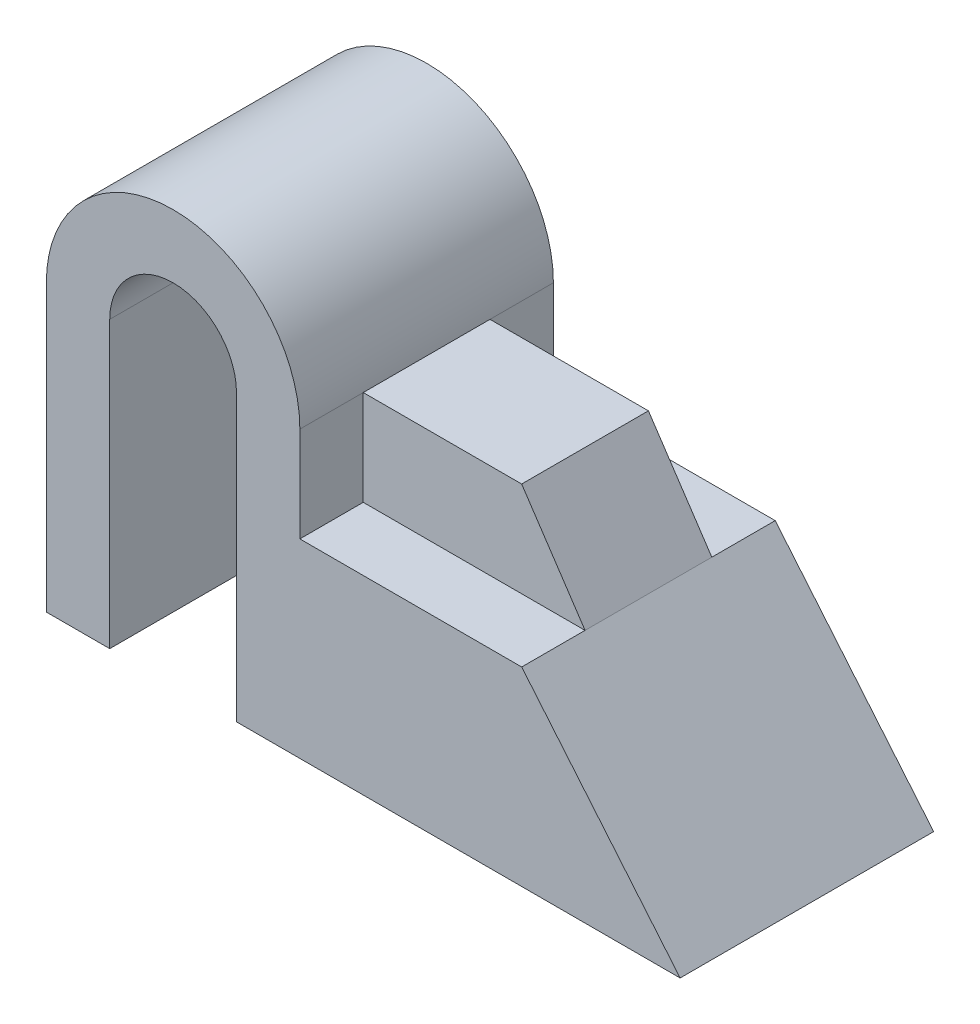
ISO-10303-21;
HEADER;
FILE_DESCRIPTION(('STEP AP214'),'2;1');
FILE_NAME('part.step','',(''),(''),'','','');
FILE_SCHEMA(('AUTOMOTIVE_DESIGN { 1 0 10303 214 1 1 1 1 }'));
ENDSEC;
DATA;
#1=APPLICATION_CONTEXT('core data for automotive mechanical design processes');
#2=APPLICATION_PROTOCOL_DEFINITION('international standard','automotive_design',2000,#1);
#3=PRODUCT_CONTEXT('',#1,'mechanical');
#4=PRODUCT('Part','Part','',(#3));
#5=PRODUCT_RELATED_PRODUCT_CATEGORY('part','',(#4));
#6=PRODUCT_DEFINITION_FORMATION('','',#4);
#7=PRODUCT_DEFINITION_CONTEXT('part definition',#1,'design');
#8=PRODUCT_DEFINITION('design','',#6,#7);
#9=PRODUCT_DEFINITION_SHAPE('','',#8);
#10=(LENGTH_UNIT() NAMED_UNIT(*) SI_UNIT(.MILLI.,.METRE.));
#11=(NAMED_UNIT(*) PLANE_ANGLE_UNIT() SI_UNIT($,.RADIAN.));
#12=(NAMED_UNIT(*) SI_UNIT($,.STERADIAN.) SOLID_ANGLE_UNIT());
#13=UNCERTAINTY_MEASURE_WITH_UNIT(LENGTH_MEASURE(1.E-05),#10,'distance_accuracy_value','');
#14=(GEOMETRIC_REPRESENTATION_CONTEXT(3) GLOBAL_UNCERTAINTY_ASSIGNED_CONTEXT((#13)) GLOBAL_UNIT_ASSIGNED_CONTEXT((#10,
#11,#12)) REPRESENTATION_CONTEXT('',''));
#15=CARTESIAN_POINT('',(0.,0.,0.));
#16=DIRECTION('',(0.,0.,1.));
#17=DIRECTION('',(1.,0.,0.));
#18=AXIS2_PLACEMENT_3D('',#15,#16,#17);
#19=CARTESIAN_POINT('',(0.,0.,20.));
#20=DIRECTION('',(0.,1.,0.));
#21=DIRECTION('',(0.,0.,1.));
#22=AXIS2_PLACEMENT_3D('',#19,#20,#21);
#23=PLANE('',#22);
#24=DIRECTION('',(0.,0.,1.));
#25=VECTOR('',#24,1.);
#26=CARTESIAN_POINT('',(10.,0.,-20.));
#27=LINE('',#26,#25);
#28=CARTESIAN_POINT('',(10.,0.,-20.));
#29=VERTEX_POINT('',#28);
#30=CARTESIAN_POINT('',(10.,0.,20.));
#31=VERTEX_POINT('',#30);
#32=EDGE_CURVE('E140',#29,#31,#27,.T.);
#33=ORIENTED_EDGE('',*,*,#32,.T.);
#34=DIRECTION('',(1.,0.,0.));
#35=VECTOR('',#34,1.);
#36=CARTESIAN_POINT('',(0.,0.,20.));
#37=LINE('',#36,#35);
#38=CARTESIAN_POINT('',(0.,0.,20.));
#39=VERTEX_POINT('',#38);
#40=EDGE_CURVE('E200',#39,#31,#37,.T.);
#41=ORIENTED_EDGE('',*,*,#40,.F.);
#42=DIRECTION('',(0.,0.,-1.));
#43=VECTOR('',#42,1.);
#44=CARTESIAN_POINT('',(0.,0.,20.));
#45=LINE('',#44,#43);
#46=CARTESIAN_POINT('',(0.,0.,-20.));
#47=VERTEX_POINT('',#46);
#48=EDGE_CURVE('E11',#39,#47,#45,.T.);
#49=ORIENTED_EDGE('',*,*,#48,.T.);
#50=DIRECTION('',(1.,0.,0.));
#51=VECTOR('',#50,1.);
#52=CARTESIAN_POINT('',(0.,0.,-20.));
#53=LINE('',#52,#51);
#54=EDGE_CURVE('E215',#47,#29,#53,.T.);
#55=ORIENTED_EDGE('',*,*,#54,.T.);
#56=EDGE_LOOP('',(#33,#41,#49,#55));
#57=FACE_BOUND('',#56,.T.);
#58=ADVANCED_FACE('F33',(#57),#23,.F.);
#59=CARTESIAN_POINT('',(20.,45.,20.));
#60=DIRECTION('',(0.,0.,-1.));
#61=DIRECTION('',(-1.,0.,0.));
#62=AXIS2_PLACEMENT_3D('',#59,#60,#61);
#63=PLANE('',#62);
#64=DIRECTION('',(0.,1.,0.));
#65=VECTOR('',#64,1.);
#66=CARTESIAN_POINT('',(10.,0.,20.));
#67=LINE('',#66,#65);
#68=CARTESIAN_POINT('',(10.,45.,20.));
#69=VERTEX_POINT('',#68);
#70=EDGE_CURVE('E160',#31,#69,#67,.T.);
#71=ORIENTED_EDGE('',*,*,#70,.T.);
#72=CARTESIAN_POINT('',(20.,45.,20.));
#73=DIRECTION('',(0.,0.,-1.));
#74=DIRECTION('',(-1.,0.,0.));
#75=AXIS2_PLACEMENT_3D('',#72,#73,#74);
#76=CIRCLE('',#75,10.);
#77=CARTESIAN_POINT('',(30.,45.,20.));
#78=VERTEX_POINT('',#77);
#79=EDGE_CURVE('E151',#69,#78,#76,.T.);
#80=ORIENTED_EDGE('',*,*,#79,.T.);
#81=DIRECTION('',(0.,1.,0.));
#82=VECTOR('',#81,1.);
#83=CARTESIAN_POINT('',(30.,0.,20.));
#84=LINE('',#83,#82);
#85=CARTESIAN_POINT('',(30.,0.,20.));
#86=VERTEX_POINT('',#85);
#87=EDGE_CURVE('E145',#86,#78,#84,.T.);
#88=ORIENTED_EDGE('',*,*,#87,.F.);
#89=CARTESIAN_POINT('',(100.,0.,20.));
#90=VERTEX_POINT('',#89);
#91=EDGE_CURVE('E198',#86,#90,#37,.T.);
#92=ORIENTED_EDGE('',*,*,#91,.T.);
#93=DIRECTION('',(-0.64018439966448,0.768221279597376,0.));
#94=VECTOR('',#93,1.);
#95=CARTESIAN_POINT('',(75.,30.,20.));
#96=LINE('',#95,#94);
#97=CARTESIAN_POINT('',(75.,30.,20.));
#98=VERTEX_POINT('',#97);
#99=EDGE_CURVE('E203',#90,#98,#96,.T.);
#100=ORIENTED_EDGE('',*,*,#99,.T.);
#101=DIRECTION('',(-1.,0.,0.));
#102=VECTOR('',#101,1.);
#103=CARTESIAN_POINT('',(40.,30.,20.));
#104=LINE('',#103,#102);
#105=CARTESIAN_POINT('',(40.,30.,20.));
#106=VERTEX_POINT('',#105);
#107=EDGE_CURVE('E205',#98,#106,#104,.T.);
#108=ORIENTED_EDGE('',*,*,#107,.T.);
#109=DIRECTION('',(0.,1.,0.));
#110=VECTOR('',#109,1.);
#111=CARTESIAN_POINT('',(40.,45.,20.));
#112=LINE('',#111,#110);
#113=CARTESIAN_POINT('',(40.,45.,20.));
#114=VERTEX_POINT('',#113);
#115=EDGE_CURVE('E207',#106,#114,#112,.T.);
#116=ORIENTED_EDGE('',*,*,#115,.T.);
#117=CARTESIAN_POINT('',(20.,45.,20.));
#118=DIRECTION('',(0.,0.,1.));
#119=DIRECTION('',(-1.,0.,0.));
#120=AXIS2_PLACEMENT_3D('',#117,#118,#119);
#121=CIRCLE('',#120,20.);
#122=CARTESIAN_POINT('',(0.,45.,20.));
#123=VERTEX_POINT('',#122);
#124=EDGE_CURVE('E209',#114,#123,#121,.T.);
#125=ORIENTED_EDGE('',*,*,#124,.T.);
#126=DIRECTION('',(0.,-1.,0.));
#127=VECTOR('',#126,1.);
#128=CARTESIAN_POINT('',(0.,45.,20.));
#129=LINE('',#128,#127);
#130=EDGE_CURVE('E195',#123,#39,#129,.T.);
#131=ORIENTED_EDGE('',*,*,#130,.T.);
#132=ORIENTED_EDGE('',*,*,#40,.T.);
#133=EDGE_LOOP('',(#71,#80,#88,#92,#100,#108,#116,#125,#131,#132));
#134=FACE_BOUND('',#133,.T.);
#135=ADVANCED_FACE('F266',(#134),#63,.F.);
#136=CARTESIAN_POINT('',(20.,45.,-20.));
#137=DIRECTION('',(0.,0.,-1.));
#138=DIRECTION('',(-1.,0.,0.));
#139=AXIS2_PLACEMENT_3D('',#136,#137,#138);
#140=PLANE('',#139);
#141=CARTESIAN_POINT('',(20.,45.,-20.));
#142=DIRECTION('',(0.,0.,-1.));
#143=DIRECTION('',(-1.,0.,0.));
#144=AXIS2_PLACEMENT_3D('',#141,#142,#143);
#145=CIRCLE('',#144,10.);
#146=CARTESIAN_POINT('',(10.,45.,-20.));
#147=VERTEX_POINT('',#146);
#148=CARTESIAN_POINT('',(30.,45.,-20.));
#149=VERTEX_POINT('',#148);
#150=EDGE_CURVE('E144',#147,#149,#145,.T.);
#151=ORIENTED_EDGE('',*,*,#150,.F.);
#152=DIRECTION('',(0.,1.,0.));
#153=VECTOR('',#152,1.);
#154=CARTESIAN_POINT('',(10.,0.,-20.));
#155=LINE('',#154,#153);
#156=EDGE_CURVE('E134',#29,#147,#155,.T.);
#157=ORIENTED_EDGE('',*,*,#156,.F.);
#158=ORIENTED_EDGE('',*,*,#54,.F.);
#159=DIRECTION('',(0.,-1.,0.));
#160=VECTOR('',#159,1.);
#161=CARTESIAN_POINT('',(0.,45.,-20.));
#162=LINE('',#161,#160);
#163=CARTESIAN_POINT('',(0.,45.,-20.));
#164=VERTEX_POINT('',#163);
#165=EDGE_CURVE('E190',#164,#47,#162,.T.);
#166=ORIENTED_EDGE('',*,*,#165,.F.);
#167=CARTESIAN_POINT('',(20.,45.,-20.));
#168=DIRECTION('',(0.,0.,1.));
#169=DIRECTION('',(-1.,0.,0.));
#170=AXIS2_PLACEMENT_3D('',#167,#168,#169);
#171=CIRCLE('',#170,20.);
#172=CARTESIAN_POINT('',(40.,45.,-20.));
#173=VERTEX_POINT('',#172);
#174=EDGE_CURVE('E199',#173,#164,#171,.T.);
#175=ORIENTED_EDGE('',*,*,#174,.F.);
#176=DIRECTION('',(0.,1.,0.));
#177=VECTOR('',#176,1.);
#178=CARTESIAN_POINT('',(40.,45.,-20.));
#179=LINE('',#178,#177);
#180=CARTESIAN_POINT('',(40.,30.,-20.));
#181=VERTEX_POINT('',#180);
#182=EDGE_CURVE('E223',#181,#173,#179,.T.);
#183=ORIENTED_EDGE('',*,*,#182,.F.);
#184=DIRECTION('',(-1.,0.,0.));
#185=VECTOR('',#184,1.);
#186=CARTESIAN_POINT('',(40.,30.,-20.));
#187=LINE('',#186,#185);
#188=CARTESIAN_POINT('',(75.,30.,-20.));
#189=VERTEX_POINT('',#188);
#190=EDGE_CURVE('E220',#189,#181,#187,.T.);
#191=ORIENTED_EDGE('',*,*,#190,.F.);
#192=DIRECTION('',(-0.64018439966448,0.768221279597376,0.));
#193=VECTOR('',#192,1.);
#194=CARTESIAN_POINT('',(75.,30.,-20.));
#195=LINE('',#194,#193);
#196=CARTESIAN_POINT('',(100.,0.,-20.));
#197=VERTEX_POINT('',#196);
#198=EDGE_CURVE('E217',#197,#189,#195,.T.);
#199=ORIENTED_EDGE('',*,*,#198,.F.);
#200=CARTESIAN_POINT('',(30.,0.,-20.));
#201=VERTEX_POINT('',#200);
#202=EDGE_CURVE('E214',#201,#197,#53,.T.);
#203=ORIENTED_EDGE('',*,*,#202,.F.);
#204=DIRECTION('',(0.,1.,0.));
#205=VECTOR('',#204,1.);
#206=CARTESIAN_POINT('',(30.,0.,-20.));
#207=LINE('',#206,#205);
#208=EDGE_CURVE('E156',#201,#149,#207,.T.);
#209=ORIENTED_EDGE('',*,*,#208,.T.);
#210=EDGE_LOOP('',(#151,#157,#158,#166,#175,#183,#191,#199,#203,#209));
#211=FACE_BOUND('',#210,.T.);
#212=ADVANCED_FACE('F154',(#211),#140,.T.);
#213=CARTESIAN_POINT('',(40.,30.,20.));
#214=DIRECTION('',(0.,-1.,0.));
#215=DIRECTION('',(0.,0.,-1.));
#216=AXIS2_PLACEMENT_3D('',#213,#214,#215);
#217=PLANE('',#216);
#218=DIRECTION('',(-1.,0.,0.));
#219=VECTOR('',#218,1.);
#220=CARTESIAN_POINT('',(75.,30.,10.));
#221=LINE('',#220,#219);
#222=CARTESIAN_POINT('',(75.,30.,10.));
#223=VERTEX_POINT('',#222);
#224=CARTESIAN_POINT('',(40.,30.,10.));
#225=VERTEX_POINT('',#224);
#226=EDGE_CURVE('E171',#223,#225,#221,.T.);
#227=ORIENTED_EDGE('',*,*,#226,.T.);
#228=DIRECTION('',(0.,0.,-1.));
#229=VECTOR('',#228,1.);
#230=CARTESIAN_POINT('',(40.,30.,20.));
#231=LINE('',#230,#229);
#232=EDGE_CURVE('E234',#106,#225,#231,.T.);
#233=ORIENTED_EDGE('',*,*,#232,.F.);
#234=ORIENTED_EDGE('',*,*,#107,.F.);
#235=DIRECTION('',(0.,0.,-1.));
#236=VECTOR('',#235,1.);
#237=CARTESIAN_POINT('',(75.,30.,20.));
#238=LINE('',#237,#236);
#239=EDGE_CURVE('E238',#98,#223,#238,.T.);
#240=ORIENTED_EDGE('',*,*,#239,.T.);
#241=EDGE_LOOP('',(#227,#233,#234,#240));
#242=FACE_BOUND('',#241,.T.);
#243=ADVANCED_FACE('F262',(#242),#217,.F.);
#244=CARTESIAN_POINT('',(40.,45.,20.));
#245=DIRECTION('',(-1.,0.,0.));
#246=DIRECTION('',(0.,0.,1.));
#247=AXIS2_PLACEMENT_3D('',#244,#245,#246);
#248=PLANE('',#247);
#249=DIRECTION('',(0.,1.,0.));
#250=VECTOR('',#249,1.);
#251=CARTESIAN_POINT('',(40.,30.,10.));
#252=LINE('',#251,#250);
#253=CARTESIAN_POINT('',(40.,45.,10.));
#254=VERTEX_POINT('',#253);
#255=EDGE_CURVE('E174',#225,#254,#252,.T.);
#256=ORIENTED_EDGE('',*,*,#255,.T.);
#257=DIRECTION('',(0.,0.,-1.));
#258=VECTOR('',#257,1.);
#259=CARTESIAN_POINT('',(40.,45.,20.));
#260=LINE('',#259,#258);
#261=EDGE_CURVE('E230',#114,#254,#260,.T.);
#262=ORIENTED_EDGE('',*,*,#261,.F.);
#263=ORIENTED_EDGE('',*,*,#115,.F.);
#264=ORIENTED_EDGE('',*,*,#232,.T.);
#265=EDGE_LOOP('',(#256,#262,#263,#264));
#266=FACE_BOUND('',#265,.T.);
#267=ADVANCED_FACE('F313',(#266),#248,.F.);
#268=CARTESIAN_POINT('',(0.,45.,20.));
#269=DIRECTION('',(1.,0.,0.));
#270=DIRECTION('',(0.,0.,-1.));
#271=AXIS2_PLACEMENT_3D('',#268,#269,#270);
#272=PLANE('',#271);
#273=ORIENTED_EDGE('',*,*,#165,.T.);
#274=ORIENTED_EDGE('',*,*,#48,.F.);
#275=ORIENTED_EDGE('',*,*,#130,.F.);
#276=DIRECTION('',(0.,0.,-1.));
#277=VECTOR('',#276,1.);
#278=CARTESIAN_POINT('',(0.,45.,20.));
#279=LINE('',#278,#277);
#280=EDGE_CURVE('E211',#123,#164,#279,.T.);
#281=ORIENTED_EDGE('',*,*,#280,.T.);
#282=EDGE_LOOP('',(#273,#274,#275,#281));
#283=FACE_BOUND('',#282,.T.);
#284=ADVANCED_FACE('F35',(#283),#272,.F.);
#285=ORIENTED_EDGE('',*,*,#91,.F.);
#286=DIRECTION('',(0.,0.,1.));
#287=VECTOR('',#286,1.);
#288=CARTESIAN_POINT('',(30.,0.,-20.));
#289=LINE('',#288,#287);
#290=EDGE_CURVE('E165',#201,#86,#289,.T.);
#291=ORIENTED_EDGE('',*,*,#290,.F.);
#292=ORIENTED_EDGE('',*,*,#202,.T.);
#293=DIRECTION('',(0.,0.,-1.));
#294=VECTOR('',#293,1.);
#295=CARTESIAN_POINT('',(100.,0.,20.));
#296=LINE('',#295,#294);
#297=EDGE_CURVE('E41',#90,#197,#296,.T.);
#298=ORIENTED_EDGE('',*,*,#297,.F.);
#299=EDGE_LOOP('',(#285,#291,#292,#298));
#300=FACE_BOUND('',#299,.T.);
#301=ADVANCED_FACE('F270',(#300),#23,.F.);
#302=CARTESIAN_POINT('',(75.,30.,20.));
#303=DIRECTION('',(-0.768221279597376,-0.64018439966448,0.));
#304=DIRECTION('',(0.64018439966448,-0.768221279597376,0.));
#305=AXIS2_PLACEMENT_3D('',#302,#303,#304);
#306=PLANE('',#305);
#307=ORIENTED_EDGE('',*,*,#198,.T.);
#308=CARTESIAN_POINT('',(75.,30.,-10.));
#309=VERTEX_POINT('',#308);
#310=EDGE_CURVE('E237',#309,#189,#238,.T.);
#311=ORIENTED_EDGE('',*,*,#310,.F.);
#312=DIRECTION('',(0.,0.,-1.));
#313=VECTOR('',#312,1.);
#314=CARTESIAN_POINT('',(75.,30.,10.));
#315=LINE('',#314,#313);
#316=EDGE_CURVE('E180',#223,#309,#315,.T.);
#317=ORIENTED_EDGE('',*,*,#316,.F.);
#318=ORIENTED_EDGE('',*,*,#239,.F.);
#319=ORIENTED_EDGE('',*,*,#99,.F.);
#320=ORIENTED_EDGE('',*,*,#297,.T.);
#321=EDGE_LOOP('',(#307,#311,#317,#318,#319,#320));
#322=FACE_BOUND('',#321,.T.);
#323=ADVANCED_FACE('F245',(#322),#306,.F.);
#324=CARTESIAN_POINT('',(40.,30.,-10.));
#325=VERTEX_POINT('',#324);
#326=EDGE_CURVE('E233',#325,#181,#231,.T.);
#327=ORIENTED_EDGE('',*,*,#326,.F.);
#328=DIRECTION('',(-1.,0.,0.));
#329=VECTOR('',#328,1.);
#330=CARTESIAN_POINT('',(75.,30.,-10.));
#331=LINE('',#330,#329);
#332=EDGE_CURVE('E183',#309,#325,#331,.T.);
#333=ORIENTED_EDGE('',*,*,#332,.F.);
#334=ORIENTED_EDGE('',*,*,#310,.T.);
#335=ORIENTED_EDGE('',*,*,#190,.T.);
#336=EDGE_LOOP('',(#327,#333,#334,#335));
#337=FACE_BOUND('',#336,.T.);
#338=ADVANCED_FACE('F255',(#337),#217,.F.);
#339=CARTESIAN_POINT('',(40.,45.,-10.));
#340=VERTEX_POINT('',#339);
#341=EDGE_CURVE('E229',#340,#173,#260,.T.);
#342=ORIENTED_EDGE('',*,*,#341,.F.);
#343=DIRECTION('',(0.,1.,0.));
#344=VECTOR('',#343,1.);
#345=CARTESIAN_POINT('',(40.,30.,-10.));
#346=LINE('',#345,#344);
#347=EDGE_CURVE('E185',#325,#340,#346,.T.);
#348=ORIENTED_EDGE('',*,*,#347,.F.);
#349=ORIENTED_EDGE('',*,*,#326,.T.);
#350=ORIENTED_EDGE('',*,*,#182,.T.);
#351=EDGE_LOOP('',(#342,#348,#349,#350));
#352=FACE_BOUND('',#351,.T.);
#353=ADVANCED_FACE('F284',(#352),#248,.F.);
#354=CARTESIAN_POINT('',(20.,45.,20.));
#355=DIRECTION('',(0.,0.,-1.));
#356=DIRECTION('',(-1.,0.,0.));
#357=AXIS2_PLACEMENT_3D('',#354,#355,#356);
#358=CYLINDRICAL_SURFACE('',#357,20.);
#359=ORIENTED_EDGE('',*,*,#174,.T.);
#360=ORIENTED_EDGE('',*,*,#280,.F.);
#361=ORIENTED_EDGE('',*,*,#124,.F.);
#362=ORIENTED_EDGE('',*,*,#261,.T.);
#363=DIRECTION('',(0.,0.,-1.));
#364=VECTOR('',#363,1.);
#365=CARTESIAN_POINT('',(40.,45.,10.));
#366=LINE('',#365,#364);
#367=EDGE_CURVE('E191',#254,#340,#366,.T.);
#368=ORIENTED_EDGE('',*,*,#367,.T.);
#369=ORIENTED_EDGE('',*,*,#341,.T.);
#370=EDGE_LOOP('',(#359,#360,#361,#362,#368,#369));
#371=FACE_BOUND('',#370,.T.);
#372=ADVANCED_FACE('F280',(#371),#358,.T.);
#373=CARTESIAN_POINT('',(64.9958445056352,45.,10.));
#374=DIRECTION('',(0.831943905555183,0.554859746250878,0.));
#375=DIRECTION('',(-0.554859746250878,0.831943905555183,0.));
#376=AXIS2_PLACEMENT_3D('',#373,#374,#375);
#377=PLANE('',#376);
#378=DIRECTION('',(0.554859746250878,-0.831943905555183,0.));
#379=VECTOR('',#378,1.);
#380=CARTESIAN_POINT('',(64.9958445056352,45.,-10.));
#381=LINE('',#380,#379);
#382=CARTESIAN_POINT('',(64.9958445056352,45.,-10.));
#383=VERTEX_POINT('',#382);
#384=EDGE_CURVE('E152',#383,#309,#381,.T.);
#385=ORIENTED_EDGE('',*,*,#384,.F.);
#386=DIRECTION('',(0.,0.,-1.));
#387=VECTOR('',#386,1.);
#388=CARTESIAN_POINT('',(64.9958445056352,45.,10.));
#389=LINE('',#388,#387);
#390=CARTESIAN_POINT('',(64.9958445056352,45.,10.));
#391=VERTEX_POINT('',#390);
#392=EDGE_CURVE('E188',#391,#383,#389,.T.);
#393=ORIENTED_EDGE('',*,*,#392,.F.);
#394=DIRECTION('',(0.554859746250878,-0.831943905555183,0.));
#395=VECTOR('',#394,1.);
#396=CARTESIAN_POINT('',(64.9958445056352,45.,10.));
#397=LINE('',#396,#395);
#398=EDGE_CURVE('E168',#391,#223,#397,.T.);
#399=ORIENTED_EDGE('',*,*,#398,.T.);
#400=ORIENTED_EDGE('',*,*,#316,.T.);
#401=EDGE_LOOP('',(#385,#393,#399,#400));
#402=FACE_BOUND('',#401,.T.);
#403=ADVANCED_FACE('F287',(#402),#377,.T.);
#404=CARTESIAN_POINT('',(40.,45.,10.));
#405=DIRECTION('',(0.,1.,0.));
#406=DIRECTION('',(0.,0.,1.));
#407=AXIS2_PLACEMENT_3D('',#404,#405,#406);
#408=PLANE('',#407);
#409=DIRECTION('',(1.,0.,0.));
#410=VECTOR('',#409,1.);
#411=CARTESIAN_POINT('',(40.,45.,-10.));
#412=LINE('',#411,#410);
#413=EDGE_CURVE('E56',#340,#383,#412,.T.);
#414=ORIENTED_EDGE('',*,*,#413,.F.);
#415=ORIENTED_EDGE('',*,*,#367,.F.);
#416=DIRECTION('',(1.,0.,0.));
#417=VECTOR('',#416,1.);
#418=CARTESIAN_POINT('',(40.,45.,10.));
#419=LINE('',#418,#417);
#420=EDGE_CURVE('E177',#254,#391,#419,.T.);
#421=ORIENTED_EDGE('',*,*,#420,.T.);
#422=ORIENTED_EDGE('',*,*,#392,.T.);
#423=EDGE_LOOP('',(#414,#415,#421,#422));
#424=FACE_BOUND('',#423,.T.);
#425=ADVANCED_FACE('F292',(#424),#408,.T.);
#426=CARTESIAN_POINT('',(0.,0.,10.));
#427=DIRECTION('',(0.,0.,-1.));
#428=DIRECTION('',(-1.,0.,0.));
#429=AXIS2_PLACEMENT_3D('',#426,#427,#428);
#430=PLANE('',#429);
#431=ORIENTED_EDGE('',*,*,#398,.F.);
#432=ORIENTED_EDGE('',*,*,#420,.F.);
#433=ORIENTED_EDGE('',*,*,#255,.F.);
#434=ORIENTED_EDGE('',*,*,#226,.F.);
#435=EDGE_LOOP('',(#431,#432,#433,#434));
#436=FACE_BOUND('',#435,.T.);
#437=ADVANCED_FACE('F291',(#436),#430,.F.);
#438=CARTESIAN_POINT('',(0.,0.,-10.));
#439=DIRECTION('',(0.,0.,-1.));
#440=DIRECTION('',(-1.,0.,0.));
#441=AXIS2_PLACEMENT_3D('',#438,#439,#440);
#442=PLANE('',#441);
#443=ORIENTED_EDGE('',*,*,#384,.T.);
#444=ORIENTED_EDGE('',*,*,#332,.T.);
#445=ORIENTED_EDGE('',*,*,#347,.T.);
#446=ORIENTED_EDGE('',*,*,#413,.T.);
#447=EDGE_LOOP('',(#443,#444,#445,#446));
#448=FACE_BOUND('',#447,.T.);
#449=ADVANCED_FACE('F286',(#448),#442,.T.);
#450=CARTESIAN_POINT('',(10.,0.,-20.));
#451=DIRECTION('',(1.,0.,0.));
#452=DIRECTION('',(0.,0.,-1.));
#453=AXIS2_PLACEMENT_3D('',#450,#451,#452);
#454=PLANE('',#453);
#455=ORIENTED_EDGE('',*,*,#70,.F.);
#456=ORIENTED_EDGE('',*,*,#32,.F.);
#457=ORIENTED_EDGE('',*,*,#156,.T.);
#458=DIRECTION('',(0.,0.,1.));
#459=VECTOR('',#458,1.);
#460=CARTESIAN_POINT('',(10.,45.,-20.));
#461=LINE('',#460,#459);
#462=EDGE_CURVE('E137',#147,#69,#461,.T.);
#463=ORIENTED_EDGE('',*,*,#462,.T.);
#464=EDGE_LOOP('',(#455,#456,#457,#463));
#465=FACE_BOUND('',#464,.T.);
#466=ADVANCED_FACE('F136',(#465),#454,.T.);
#467=CARTESIAN_POINT('',(20.,45.,-20.));
#468=DIRECTION('',(0.,0.,1.));
#469=DIRECTION('',(1.,0.,0.));
#470=AXIS2_PLACEMENT_3D('',#467,#468,#469);
#471=CYLINDRICAL_SURFACE('',#470,10.);
#472=ORIENTED_EDGE('',*,*,#79,.F.);
#473=ORIENTED_EDGE('',*,*,#462,.F.);
#474=ORIENTED_EDGE('',*,*,#150,.T.);
#475=DIRECTION('',(0.,0.,1.));
#476=VECTOR('',#475,1.);
#477=CARTESIAN_POINT('',(30.,45.,-20.));
#478=LINE('',#477,#476);
#479=EDGE_CURVE('E48',#149,#78,#478,.T.);
#480=ORIENTED_EDGE('',*,*,#479,.T.);
#481=EDGE_LOOP('',(#472,#473,#474,#480));
#482=FACE_BOUND('',#481,.T.);
#483=ADVANCED_FACE('F148',(#482),#471,.F.);
#484=CARTESIAN_POINT('',(30.,0.,-20.));
#485=DIRECTION('',(1.,0.,0.));
#486=DIRECTION('',(0.,0.,-1.));
#487=AXIS2_PLACEMENT_3D('',#484,#485,#486);
#488=PLANE('',#487);
#489=ORIENTED_EDGE('',*,*,#87,.T.);
#490=ORIENTED_EDGE('',*,*,#479,.F.);
#491=ORIENTED_EDGE('',*,*,#208,.F.);
#492=ORIENTED_EDGE('',*,*,#290,.T.);
#493=EDGE_LOOP('',(#489,#490,#491,#492));
#494=FACE_BOUND('',#493,.T.);
#495=ADVANCED_FACE('F271',(#494),#488,.F.);
#496=CLOSED_SHELL('',(#58,#135,#212,#243,#267,#284,#301,#323,#338,#353,#372,#403,#425,#437,#449,
#466,#483,#495));
#497=MANIFOLD_SOLID_BREP('B2',#496);
#498=ADVANCED_BREP_SHAPE_REPRESENTATION('',(#18,#497),#14);
#499=SHAPE_DEFINITION_REPRESENTATION(#9,#498);
ENDSEC;
END-ISO-10303-21;
